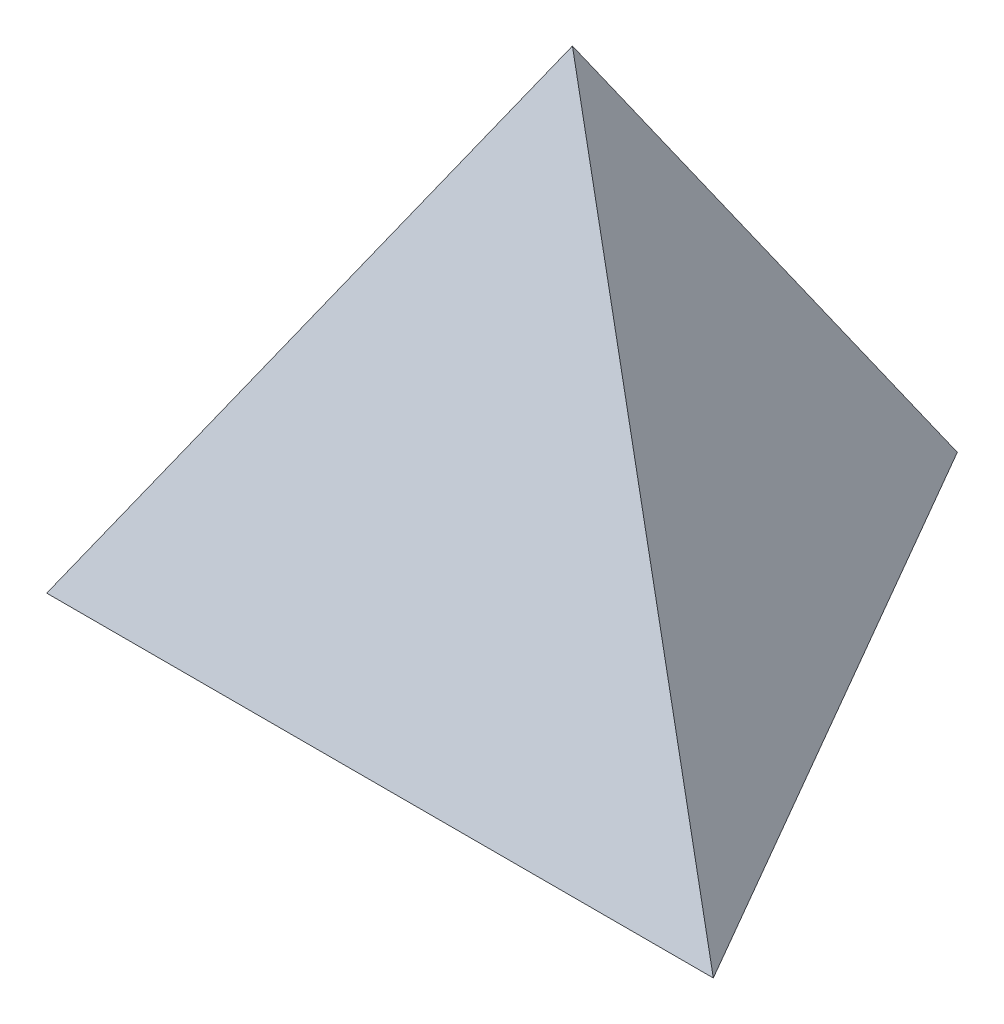
ISO-10303-21;
HEADER;
FILE_DESCRIPTION(('STEP AP214'),'2;1');
FILE_NAME('part.step','',(''),(''),'','','');
FILE_SCHEMA(('AUTOMOTIVE_DESIGN { 1 0 10303 214 1 1 1 1 }'));
ENDSEC;
DATA;
#1=APPLICATION_CONTEXT('core data for automotive mechanical design processes');
#2=APPLICATION_PROTOCOL_DEFINITION('international standard','automotive_design',2000,#1);
#3=PRODUCT_CONTEXT('',#1,'mechanical');
#4=PRODUCT('Part','Part','',(#3));
#5=PRODUCT_RELATED_PRODUCT_CATEGORY('part','',(#4));
#6=PRODUCT_DEFINITION_FORMATION('','',#4);
#7=PRODUCT_DEFINITION_CONTEXT('part definition',#1,'design');
#8=PRODUCT_DEFINITION('design','',#6,#7);
#9=PRODUCT_DEFINITION_SHAPE('','',#8);
#10=(LENGTH_UNIT() NAMED_UNIT(*) SI_UNIT(.MILLI.,.METRE.));
#11=(NAMED_UNIT(*) PLANE_ANGLE_UNIT() SI_UNIT($,.RADIAN.));
#12=(NAMED_UNIT(*) SI_UNIT($,.STERADIAN.) SOLID_ANGLE_UNIT());
#13=UNCERTAINTY_MEASURE_WITH_UNIT(LENGTH_MEASURE(1.E-05),#10,'distance_accuracy_value','');
#14=(GEOMETRIC_REPRESENTATION_CONTEXT(3) GLOBAL_UNCERTAINTY_ASSIGNED_CONTEXT((#13)) GLOBAL_UNIT_ASSIGNED_CONTEXT((#10,
#11,#12)) REPRESENTATION_CONTEXT('',''));
#15=CARTESIAN_POINT('',(0.,0.,0.));
#16=DIRECTION('',(0.,0.,1.));
#17=DIRECTION('',(1.,0.,0.));
#18=AXIS2_PLACEMENT_3D('',#15,#16,#17);
#19=CARTESIAN_POINT('',(0.,4.60866959012538,13.0352860777035));
#20=DIRECTION('',(0.,0.333333333333333,0.942809041582063));
#21=DIRECTION('',(0.,-0.942809041582063,0.333333333333333));
#22=AXIS2_PLACEMENT_3D('',#19,#20,#21);
#23=PLANE('',#22);
#24=DIRECTION('',(1.,0.,0.));
#25=VECTOR('',#24,1.);
#26=CARTESIAN_POINT('',(-25.4,0.,14.6646968374165));
#27=LINE('',#26,#25);
#28=CARTESIAN_POINT('',(-25.4,0.,14.6646968374165));
#29=VERTEX_POINT('',#28);
#30=CARTESIAN_POINT('',(25.4,0.,14.6646968374165));
#31=VERTEX_POINT('',#30);
#32=EDGE_CURVE('E64',#29,#31,#27,.T.);
#33=ORIENTED_EDGE('',*,*,#32,.T.);
#34=DIRECTION('',(-0.5,0.816496580927726,-0.288675134594813));
#35=VECTOR('',#34,1.);
#36=CARTESIAN_POINT('',(12.7,20.7390131555643,7.33234841870824));
#37=LINE('',#36,#35);
#38=CARTESIAN_POINT('',(0.,41.4780263111285,0.));
#39=VERTEX_POINT('',#38);
#40=EDGE_CURVE('E67',#31,#39,#37,.T.);
#41=ORIENTED_EDGE('',*,*,#40,.T.);
#42=DIRECTION('',(-0.5,-0.816496580927726,0.288675134594813));
#43=VECTOR('',#42,1.);
#44=CARTESIAN_POINT('',(0.,41.4780263111285,0.));
#45=LINE('',#44,#43);
#46=EDGE_CURVE('E49',#39,#29,#45,.T.);
#47=ORIENTED_EDGE('',*,*,#46,.T.);
#48=EDGE_LOOP('',(#33,#41,#47));
#49=FACE_BOUND('',#48,.T.);
#50=ADVANCED_FACE('F34',(#49),#23,.T.);
#51=CARTESIAN_POINT('',(25.4,41.4780263111285,43.9940905122495));
#52=DIRECTION('',(-0.816496580927726,-0.333333333333333,0.471404520791032));
#53=DIRECTION('',(0.5,0.,0.866025403784439));
#54=AXIS2_PLACEMENT_3D('',#51,#52,#53);
#55=PLANE('',#54);
#56=ORIENTED_EDGE('',*,*,#40,.F.);
#57=DIRECTION('',(-0.5,0.,-0.866025403784439));
#58=VECTOR('',#57,1.);
#59=CARTESIAN_POINT('',(25.4,0.,14.6646968374165));
#60=LINE('',#59,#58);
#61=CARTESIAN_POINT('',(0.,0.,-29.329393674833));
#62=VERTEX_POINT('',#61);
#63=EDGE_CURVE('E58',#31,#62,#60,.T.);
#64=ORIENTED_EDGE('',*,*,#63,.T.);
#65=DIRECTION('',(0.,-0.816496580927726,-0.577350269189626));
#66=VECTOR('',#65,1.);
#67=CARTESIAN_POINT('',(0.,41.4780263111285,0.));
#68=LINE('',#67,#66);
#69=EDGE_CURVE('E12',#39,#62,#68,.T.);
#70=ORIENTED_EDGE('',*,*,#69,.F.);
#71=EDGE_LOOP('',(#56,#64,#70));
#72=FACE_BOUND('',#71,.T.);
#73=ADVANCED_FACE('F36',(#72),#55,.F.);
#74=CARTESIAN_POINT('',(0.,41.4780263111285,0.));
#75=DIRECTION('',(0.816496580927726,-0.333333333333333,0.471404520791032));
#76=DIRECTION('',(0.5,0.,-0.866025403784439));
#77=AXIS2_PLACEMENT_3D('',#74,#75,#76);
#78=PLANE('',#77);
#79=ORIENTED_EDGE('',*,*,#46,.F.);
#80=ORIENTED_EDGE('',*,*,#69,.T.);
#81=DIRECTION('',(-0.5,0.,0.866025403784439));
#82=VECTOR('',#81,1.);
#83=CARTESIAN_POINT('',(0.,0.,-29.329393674833));
#84=LINE('',#83,#82);
#85=EDGE_CURVE('E43',#62,#29,#84,.T.);
#86=ORIENTED_EDGE('',*,*,#85,.T.);
#87=EDGE_LOOP('',(#79,#80,#86));
#88=FACE_BOUND('',#87,.T.);
#89=ADVANCED_FACE('F72',(#88),#78,.F.);
#90=CARTESIAN_POINT('',(0.,0.,0.));
#91=DIRECTION('',(0.,1.,0.));
#92=DIRECTION('',(0.,0.,1.));
#93=AXIS2_PLACEMENT_3D('',#90,#91,#92);
#94=PLANE('',#93);
#95=ORIENTED_EDGE('',*,*,#32,.F.);
#96=ORIENTED_EDGE('',*,*,#85,.F.);
#97=ORIENTED_EDGE('',*,*,#63,.F.);
#98=EDGE_LOOP('',(#95,#96,#97));
#99=FACE_BOUND('',#98,.T.);
#100=ADVANCED_FACE('F62',(#99),#94,.F.);
#101=CLOSED_SHELL('',(#50,#73,#89,#100));
#102=MANIFOLD_SOLID_BREP('B2',#101);
#103=ADVANCED_BREP_SHAPE_REPRESENTATION('',(#18,#102),#14);
#104=SHAPE_DEFINITION_REPRESENTATION(#9,#103);
ENDSEC;
END-ISO-10303-21;
